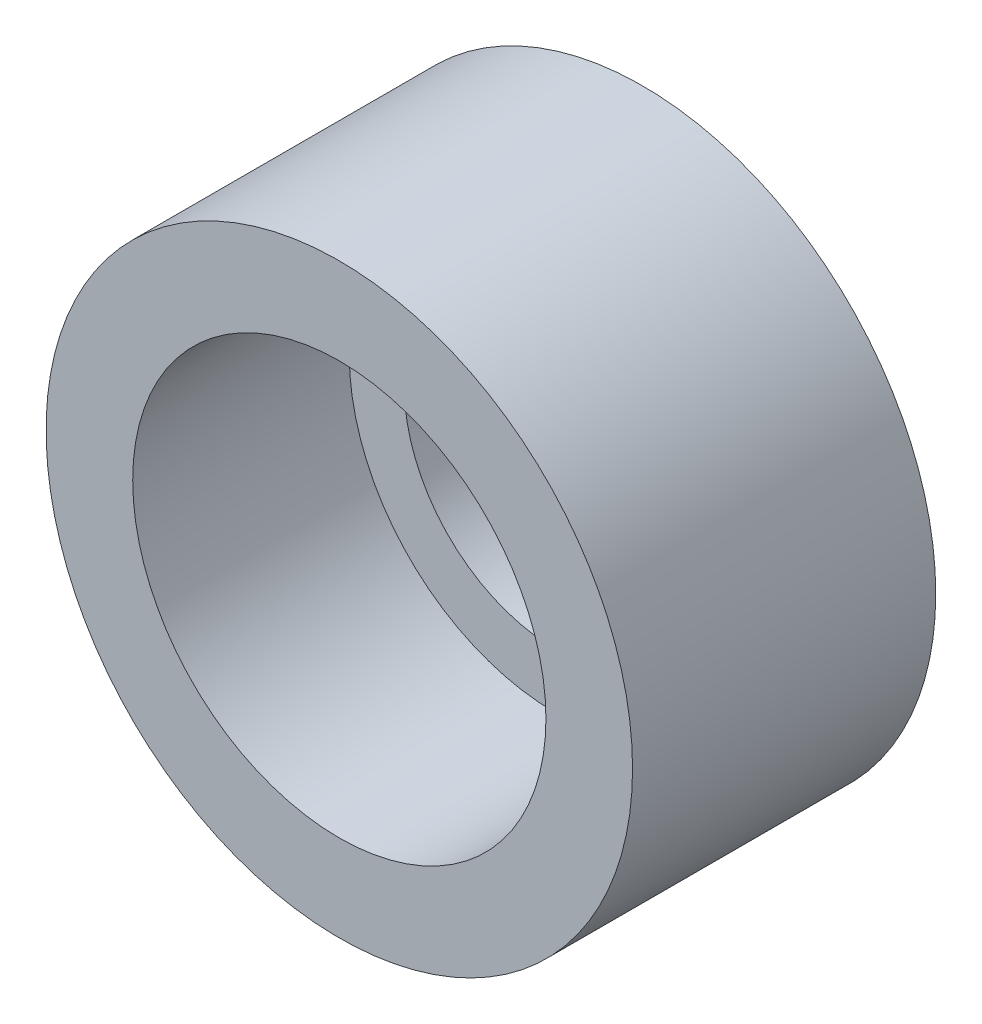
ISO-10303-21;
HEADER;
FILE_DESCRIPTION(('STEP AP214'),'2;1');
FILE_NAME('part.step','',(''),(''),'','','');
FILE_SCHEMA(('AUTOMOTIVE_DESIGN { 1 0 10303 214 1 1 1 1 }'));
ENDSEC;
DATA;
#1=APPLICATION_CONTEXT('core data for automotive mechanical design processes');
#2=APPLICATION_PROTOCOL_DEFINITION('international standard','automotive_design',2000,#1);
#3=PRODUCT_CONTEXT('',#1,'mechanical');
#4=PRODUCT('Part','Part','',(#3));
#5=PRODUCT_RELATED_PRODUCT_CATEGORY('part','',(#4));
#6=PRODUCT_DEFINITION_FORMATION('','',#4);
#7=PRODUCT_DEFINITION_CONTEXT('part definition',#1,'design');
#8=PRODUCT_DEFINITION('design','',#6,#7);
#9=PRODUCT_DEFINITION_SHAPE('','',#8);
#10=(LENGTH_UNIT() NAMED_UNIT(*) SI_UNIT(.MILLI.,.METRE.));
#11=(NAMED_UNIT(*) PLANE_ANGLE_UNIT() SI_UNIT($,.RADIAN.));
#12=(NAMED_UNIT(*) SI_UNIT($,.STERADIAN.) SOLID_ANGLE_UNIT());
#13=UNCERTAINTY_MEASURE_WITH_UNIT(LENGTH_MEASURE(1.E-05),#10,'distance_accuracy_value','');
#14=(GEOMETRIC_REPRESENTATION_CONTEXT(3) GLOBAL_UNCERTAINTY_ASSIGNED_CONTEXT((#13)) GLOBAL_UNIT_ASSIGNED_CONTEXT((#10,
#11,#12)) REPRESENTATION_CONTEXT('',''));
#15=CARTESIAN_POINT('',(0.,0.,0.));
#16=DIRECTION('',(0.,0.,1.));
#17=DIRECTION('',(1.,0.,0.));
#18=AXIS2_PLACEMENT_3D('',#15,#16,#17);
#19=CARTESIAN_POINT('',(0.,0.,6.35));
#20=DIRECTION('',(0.,0.,1.));
#21=DIRECTION('',(1.,0.,0.));
#22=AXIS2_PLACEMENT_3D('',#19,#20,#21);
#23=PLANE('',#22);
#24=CARTESIAN_POINT('',(0.,0.,6.35));
#25=DIRECTION('',(0.,0.,1.));
#26=DIRECTION('',(1.,0.,0.));
#27=AXIS2_PLACEMENT_3D('',#24,#25,#26);
#28=CIRCLE('',#27,8.598499948);
#29=CARTESIAN_POINT('',(8.598499948,0.,6.35));
#30=VERTEX_POINT('',#29);
#31=EDGE_CURVE('E10',#30,#30,#28,.T.);
#32=ORIENTED_EDGE('',*,*,#31,.T.);
#33=EDGE_LOOP('',(#32));
#34=FACE_BOUND('',#33,.T.);
#35=CARTESIAN_POINT('',(0.,0.,6.35));
#36=DIRECTION('',(0.,0.,1.));
#37=DIRECTION('',(1.,0.,0.));
#38=AXIS2_PLACEMENT_3D('',#35,#36,#37);
#39=CIRCLE('',#38,6.058499948);
#40=CARTESIAN_POINT('',(6.058499948,0.,6.35));
#41=VERTEX_POINT('',#40);
#42=EDGE_CURVE('E43',#41,#41,#39,.T.);
#43=ORIENTED_EDGE('',*,*,#42,.F.);
#44=EDGE_LOOP('',(#43));
#45=FACE_BOUND('',#44,.T.);
#46=ADVANCED_FACE('F36',(#34,#45),#23,.T.);
#47=CARTESIAN_POINT('',(0.,0.,6.35));
#48=DIRECTION('',(0.,0.,-1.));
#49=DIRECTION('',(-1.,0.,0.));
#50=AXIS2_PLACEMENT_3D('',#47,#48,#49);
#51=CYLINDRICAL_SURFACE('',#50,8.598499948);
#52=ORIENTED_EDGE('',*,*,#31,.F.);
#53=EDGE_LOOP('',(#52));
#54=FACE_BOUND('',#53,.T.);
#55=CARTESIAN_POINT('',(0.,0.,-2.54));
#56=DIRECTION('',(0.,0.,1.));
#57=DIRECTION('',(1.,0.,0.));
#58=AXIS2_PLACEMENT_3D('',#55,#56,#57);
#59=CIRCLE('',#58,8.598499948);
#60=CARTESIAN_POINT('',(8.598499948,0.,-2.54));
#61=VERTEX_POINT('',#60);
#62=EDGE_CURVE('E52',#61,#61,#59,.T.);
#63=ORIENTED_EDGE('',*,*,#62,.T.);
#64=EDGE_LOOP('',(#63));
#65=FACE_BOUND('',#64,.T.);
#66=ADVANCED_FACE('F38',(#54,#65),#51,.T.);
#67=CARTESIAN_POINT('',(0.,0.,6.35));
#68=DIRECTION('',(0.,0.,-1.));
#69=DIRECTION('',(-1.,0.,0.));
#70=AXIS2_PLACEMENT_3D('',#67,#68,#69);
#71=CYLINDRICAL_SURFACE('',#70,6.058499948);
#72=ORIENTED_EDGE('',*,*,#42,.T.);
#73=EDGE_LOOP('',(#72));
#74=FACE_BOUND('',#73,.T.);
#75=CARTESIAN_POINT('',(0.,0.,0.));
#76=DIRECTION('',(0.,0.,1.));
#77=DIRECTION('',(1.,0.,0.));
#78=AXIS2_PLACEMENT_3D('',#75,#76,#77);
#79=CIRCLE('',#78,6.058499948);
#80=CARTESIAN_POINT('',(6.058499948,0.,0.));
#81=VERTEX_POINT('',#80);
#82=EDGE_CURVE('E47',#81,#81,#79,.T.);
#83=ORIENTED_EDGE('',*,*,#82,.F.);
#84=EDGE_LOOP('',(#83));
#85=FACE_BOUND('',#84,.T.);
#86=ADVANCED_FACE('F73',(#74,#85),#71,.F.);
#87=CARTESIAN_POINT('',(0.,0.,0.));
#88=DIRECTION('',(0.,0.,1.));
#89=DIRECTION('',(1.,0.,0.));
#90=AXIS2_PLACEMENT_3D('',#87,#88,#89);
#91=PLANE('',#90);
#92=CARTESIAN_POINT('',(0.,0.,0.));
#93=DIRECTION('',(0.,0.,1.));
#94=DIRECTION('',(1.,0.,0.));
#95=AXIS2_PLACEMENT_3D('',#92,#93,#94);
#96=CIRCLE('',#95,4.445);
#97=CARTESIAN_POINT('',(4.445,0.,0.));
#98=VERTEX_POINT('',#97);
#99=EDGE_CURVE('E56',#98,#98,#96,.T.);
#100=ORIENTED_EDGE('',*,*,#99,.F.);
#101=EDGE_LOOP('',(#100));
#102=FACE_BOUND('',#101,.T.);
#103=ORIENTED_EDGE('',*,*,#82,.T.);
#104=EDGE_LOOP('',(#103));
#105=FACE_BOUND('',#104,.T.);
#106=ADVANCED_FACE('F68',(#102,#105),#91,.T.);
#107=CARTESIAN_POINT('',(0.,0.,-2.54));
#108=DIRECTION('',(0.,0.,1.));
#109=DIRECTION('',(1.,0.,0.));
#110=AXIS2_PLACEMENT_3D('',#107,#108,#109);
#111=PLANE('',#110);
#112=CARTESIAN_POINT('',(0.,0.,-2.54));
#113=DIRECTION('',(0.,0.,-1.));
#114=DIRECTION('',(-1.,0.,0.));
#115=AXIS2_PLACEMENT_3D('',#112,#113,#114);
#116=CIRCLE('',#115,4.445);
#117=CARTESIAN_POINT('',(-4.445,0.,-2.54));
#118=VERTEX_POINT('',#117);
#119=EDGE_CURVE('E59',#118,#118,#116,.T.);
#120=ORIENTED_EDGE('',*,*,#119,.F.);
#121=EDGE_LOOP('',(#120));
#122=FACE_BOUND('',#121,.T.);
#123=ORIENTED_EDGE('',*,*,#62,.F.);
#124=EDGE_LOOP('',(#123));
#125=FACE_BOUND('',#124,.T.);
#126=ADVANCED_FACE('F65',(#122,#125),#111,.F.);
#127=CARTESIAN_POINT('',(0.,0.,6.35));
#128=DIRECTION('',(0.,0.,-1.));
#129=DIRECTION('',(-1.,0.,0.));
#130=AXIS2_PLACEMENT_3D('',#127,#128,#129);
#131=CYLINDRICAL_SURFACE('',#130,4.445);
#132=ORIENTED_EDGE('',*,*,#99,.T.);
#133=EDGE_LOOP('',(#132));
#134=FACE_BOUND('',#133,.T.);
#135=ORIENTED_EDGE('',*,*,#119,.T.);
#136=EDGE_LOOP('',(#135));
#137=FACE_BOUND('',#136,.T.);
#138=ADVANCED_FACE('F63',(#134,#137),#131,.F.);
#139=CLOSED_SHELL('',(#46,#66,#86,#106,#126,#138));
#140=MANIFOLD_SOLID_BREP('B2',#139);
#141=ADVANCED_BREP_SHAPE_REPRESENTATION('',(#18,#140),#14);
#142=SHAPE_DEFINITION_REPRESENTATION(#9,#141);
ENDSEC;
END-ISO-10303-21;
